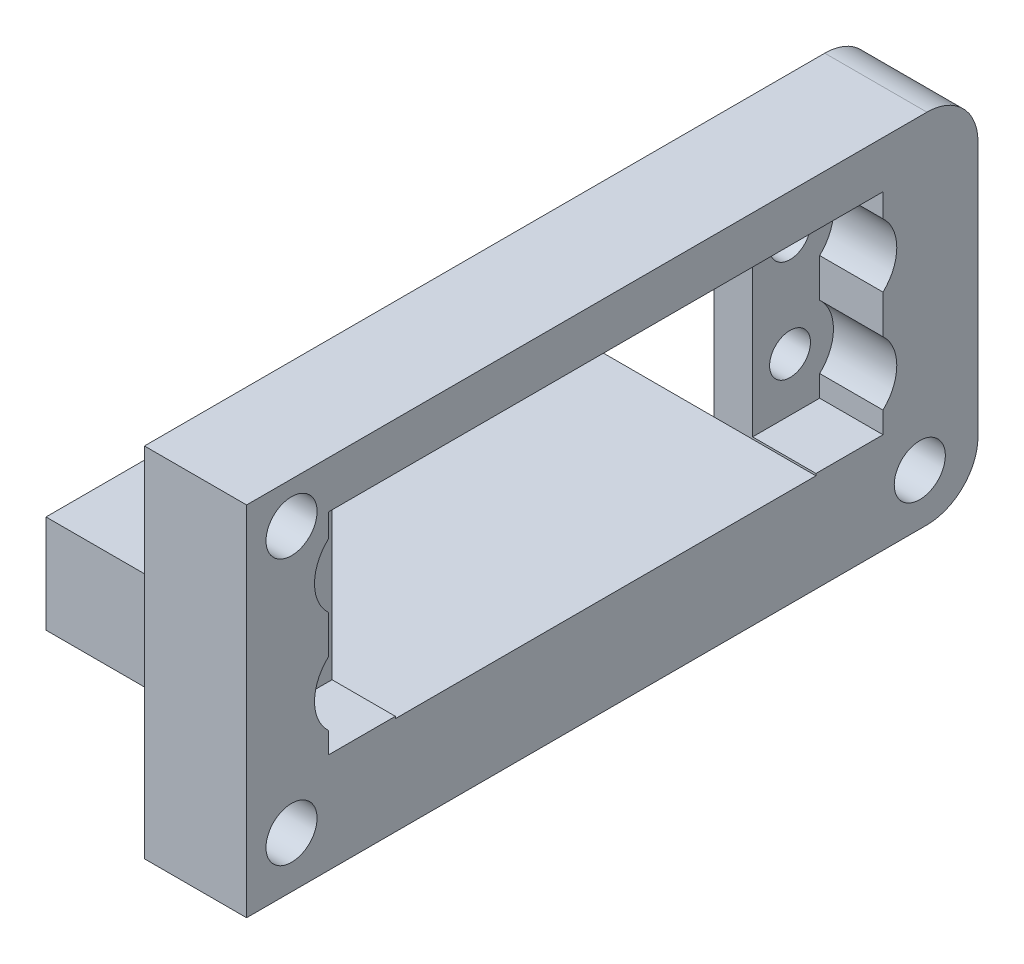
ISO-10303-21;
HEADER;
FILE_DESCRIPTION(('STEP AP214'),'2;1');
FILE_NAME('part.step','',(''),(''),'','','');
FILE_SCHEMA(('AUTOMOTIVE_DESIGN { 1 0 10303 214 1 1 1 1 }'));
ENDSEC;
DATA;
#1=APPLICATION_CONTEXT('core data for automotive mechanical design processes');
#2=APPLICATION_PROTOCOL_DEFINITION('international standard','automotive_design',2000,#1);
#3=PRODUCT_CONTEXT('',#1,'mechanical');
#4=PRODUCT('Part','Part','',(#3));
#5=PRODUCT_RELATED_PRODUCT_CATEGORY('part','',(#4));
#6=PRODUCT_DEFINITION_FORMATION('','',#4);
#7=PRODUCT_DEFINITION_CONTEXT('part definition',#1,'design');
#8=PRODUCT_DEFINITION('design','',#6,#7);
#9=PRODUCT_DEFINITION_SHAPE('','',#8);
#10=(LENGTH_UNIT() NAMED_UNIT(*) SI_UNIT(.MILLI.,.METRE.));
#11=(NAMED_UNIT(*) PLANE_ANGLE_UNIT() SI_UNIT($,.RADIAN.));
#12=(NAMED_UNIT(*) SI_UNIT($,.STERADIAN.) SOLID_ANGLE_UNIT());
#13=UNCERTAINTY_MEASURE_WITH_UNIT(LENGTH_MEASURE(1.E-05),#10,'distance_accuracy_value','');
#14=(GEOMETRIC_REPRESENTATION_CONTEXT(3) GLOBAL_UNCERTAINTY_ASSIGNED_CONTEXT((#13)) GLOBAL_UNIT_ASSIGNED_CONTEXT((#10,
#11,#12)) REPRESENTATION_CONTEXT('',''));
#15=CARTESIAN_POINT('',(0.,0.,0.));
#16=DIRECTION('',(0.,0.,1.));
#17=DIRECTION('',(1.,0.,0.));
#18=AXIS2_PLACEMENT_3D('',#15,#16,#17);
#19=CARTESIAN_POINT('',(-98.3966749620083,0.,-51.95));
#20=DIRECTION('',(0.,0.,1.));
#21=DIRECTION('',(1.,0.,0.));
#22=AXIS2_PLACEMENT_3D('',#19,#20,#21);
#23=PLANE('',#22);
#24=DIRECTION('',(1.,0.,0.));
#25=VECTOR('',#24,1.);
#26=CARTESIAN_POINT('',(-25.058655518268,11.8931527234188,-51.95));
#27=LINE('',#26,#25);
#28=CARTESIAN_POINT('',(-18.7,11.8931527234188,-51.95));
#29=VERTEX_POINT('',#28);
#30=CARTESIAN_POINT('',(-12.5,11.8931527234188,-51.95));
#31=VERTEX_POINT('',#30);
#32=EDGE_CURVE('E476',#29,#31,#27,.T.);
#33=ORIENTED_EDGE('',*,*,#32,.F.);
#34=DIRECTION('',(0.,-1.,0.));
#35=VECTOR('',#34,1.);
#36=CARTESIAN_POINT('',(-18.7,0.,-51.95));
#37=LINE('',#36,#35);
#38=CARTESIAN_POINT('',(-18.7,9.79999999999999,-51.95));
#39=VERTEX_POINT('',#38);
#40=EDGE_CURVE('E285',#29,#39,#37,.T.);
#41=ORIENTED_EDGE('',*,*,#40,.T.);
#42=DIRECTION('',(1.,0.,0.));
#43=VECTOR('',#42,1.);
#44=CARTESIAN_POINT('',(-98.3966749620083,9.79999999999999,-51.95));
#45=LINE('',#44,#43);
#46=CARTESIAN_POINT('',(-12.5,9.79999999999999,-51.95));
#47=VERTEX_POINT('',#46);
#48=EDGE_CURVE('E283',#39,#47,#45,.T.);
#49=ORIENTED_EDGE('',*,*,#48,.T.);
#50=DIRECTION('',(0.,-1.,0.));
#51=VECTOR('',#50,1.);
#52=CARTESIAN_POINT('',(-12.5,0.,-51.95));
#53=LINE('',#52,#51);
#54=EDGE_CURVE('E518',#31,#47,#53,.T.);
#55=ORIENTED_EDGE('',*,*,#54,.F.);
#56=EDGE_LOOP('',(#33,#41,#49,#55));
#57=FACE_BOUND('',#56,.T.);
#58=ADVANCED_FACE('F45',(#57),#23,.T.);
#59=DIRECTION('',(1.,0.,0.));
#60=VECTOR('',#59,1.);
#61=CARTESIAN_POINT('',(-25.058655518268,18.1068472765812,-51.95));
#62=LINE('',#61,#60);
#63=CARTESIAN_POINT('',(-18.7,18.1068472765812,-51.95));
#64=VERTEX_POINT('',#63);
#65=CARTESIAN_POINT('',(-12.5,18.1068472765812,-51.95));
#66=VERTEX_POINT('',#65);
#67=EDGE_CURVE('E488',#64,#66,#62,.T.);
#68=ORIENTED_EDGE('',*,*,#67,.T.);
#69=CARTESIAN_POINT('',(-12.5,21.8931527234188,-51.95));
#70=VERTEX_POINT('',#69);
#71=EDGE_CURVE('E519',#70,#66,#53,.T.);
#72=ORIENTED_EDGE('',*,*,#71,.F.);
#73=DIRECTION('',(1.,0.,0.));
#74=VECTOR('',#73,1.);
#75=CARTESIAN_POINT('',(-25.058655518268,21.8931527234188,-51.95));
#76=LINE('',#75,#74);
#77=CARTESIAN_POINT('',(-18.7,21.8931527234188,-51.95));
#78=VERTEX_POINT('',#77);
#79=EDGE_CURVE('E448',#78,#70,#76,.T.);
#80=ORIENTED_EDGE('',*,*,#79,.F.);
#81=EDGE_CURVE('E284',#78,#64,#37,.T.);
#82=ORIENTED_EDGE('',*,*,#81,.T.);
#83=EDGE_LOOP('',(#68,#72,#80,#82));
#84=FACE_BOUND('',#83,.T.);
#85=ADVANCED_FACE('F527',(#84),#23,.T.);
#86=CARTESIAN_POINT('',(-98.3966749620083,0.,2.35));
#87=DIRECTION('',(0.,0.,1.));
#88=DIRECTION('',(0.,-1.,0.));
#89=AXIS2_PLACEMENT_3D('',#86,#87,#88);
#90=PLANE('',#89);
#91=DIRECTION('',(0.,-1.,0.));
#92=VECTOR('',#91,1.);
#93=CARTESIAN_POINT('',(-18.7,0.,2.35));
#94=LINE('',#93,#92);
#95=CARTESIAN_POINT('',(-18.7,21.8931527234188,2.35));
#96=VERTEX_POINT('',#95);
#97=CARTESIAN_POINT('',(-18.7,18.1068472765812,2.35));
#98=VERTEX_POINT('',#97);
#99=EDGE_CURVE('E54',#96,#98,#94,.T.);
#100=ORIENTED_EDGE('',*,*,#99,.F.);
#101=DIRECTION('',(1.,0.,0.));
#102=VECTOR('',#101,1.);
#103=CARTESIAN_POINT('',(-25.058655518268,21.8931527234188,2.35));
#104=LINE('',#103,#102);
#105=CARTESIAN_POINT('',(-12.5,21.8931527234188,2.35));
#106=VERTEX_POINT('',#105);
#107=EDGE_CURVE('E480',#96,#106,#104,.T.);
#108=ORIENTED_EDGE('',*,*,#107,.T.);
#109=DIRECTION('',(0.,-1.,0.));
#110=VECTOR('',#109,1.);
#111=CARTESIAN_POINT('',(-12.5,0.,2.35));
#112=LINE('',#111,#110);
#113=CARTESIAN_POINT('',(-12.5,18.1068472765812,2.35));
#114=VERTEX_POINT('',#113);
#115=EDGE_CURVE('E253',#106,#114,#112,.T.);
#116=ORIENTED_EDGE('',*,*,#115,.T.);
#117=DIRECTION('',(1.,0.,0.));
#118=VECTOR('',#117,1.);
#119=CARTESIAN_POINT('',(-25.058655518268,18.1068472765812,2.35));
#120=LINE('',#119,#118);
#121=EDGE_CURVE('E233',#98,#114,#120,.T.);
#122=ORIENTED_EDGE('',*,*,#121,.F.);
#123=EDGE_LOOP('',(#100,#108,#116,#122));
#124=FACE_BOUND('',#123,.T.);
#125=ADVANCED_FACE('F500',(#124),#90,.F.);
#126=CARTESIAN_POINT('',(-18.7,11.8931527234188,2.35));
#127=VERTEX_POINT('',#126);
#128=CARTESIAN_POINT('',(-18.7,9.79999999999999,2.35));
#129=VERTEX_POINT('',#128);
#130=EDGE_CURVE('E56',#127,#129,#94,.T.);
#131=ORIENTED_EDGE('',*,*,#130,.F.);
#132=DIRECTION('',(1.,0.,0.));
#133=VECTOR('',#132,1.);
#134=CARTESIAN_POINT('',(-25.058655518268,11.8931527234188,2.35));
#135=LINE('',#134,#133);
#136=CARTESIAN_POINT('',(-12.5,11.8931527234188,2.35));
#137=VERTEX_POINT('',#136);
#138=EDGE_CURVE('E230',#127,#137,#135,.T.);
#139=ORIENTED_EDGE('',*,*,#138,.T.);
#140=CARTESIAN_POINT('',(-12.5,9.79999999999999,2.35));
#141=VERTEX_POINT('',#140);
#142=EDGE_CURVE('E243',#137,#141,#112,.T.);
#143=ORIENTED_EDGE('',*,*,#142,.T.);
#144=DIRECTION('',(1.,0.,0.));
#145=VECTOR('',#144,1.);
#146=CARTESIAN_POINT('',(-98.3966749620083,9.79999999999999,2.35));
#147=LINE('',#146,#145);
#148=EDGE_CURVE('E267',#129,#141,#147,.T.);
#149=ORIENTED_EDGE('',*,*,#148,.F.);
#150=EDGE_LOOP('',(#131,#139,#143,#149));
#151=FACE_BOUND('',#150,.T.);
#152=ADVANCED_FACE('F241',(#151),#90,.F.);
#153=CARTESIAN_POINT('',(-22.5,0.,0.));
#154=DIRECTION('',(-1.,0.,0.));
#155=DIRECTION('',(0.,0.,1.));
#156=AXIS2_PLACEMENT_3D('',#153,#154,#155);
#157=PLANE('',#156);
#158=CARTESIAN_POINT('',(-22.5,15.,-0.550000000000007));
#159=DIRECTION('',(-1.,0.,0.));
#160=DIRECTION('',(0.,0.,1.));
#161=AXIS2_PLACEMENT_3D('',#158,#159,#160);
#162=CIRCLE('',#161,2.00000000000001);
#163=CARTESIAN_POINT('',(-22.5,15.,1.45));
#164=VERTEX_POINT('',#163);
#165=EDGE_CURVE('E322',#164,#164,#162,.T.);
#166=ORIENTED_EDGE('',*,*,#165,.F.);
#167=EDGE_LOOP('',(#166));
#168=FACE_BOUND('',#167,.T.);
#169=CARTESIAN_POINT('',(-22.5,15.,-49.05));
#170=DIRECTION('',(-1.,0.,0.));
#171=DIRECTION('',(0.,0.,1.));
#172=AXIS2_PLACEMENT_3D('',#169,#170,#171);
#173=CIRCLE('',#172,2.00000000000002);
#174=CARTESIAN_POINT('',(-22.5,15.,-47.05));
#175=VERTEX_POINT('',#174);
#176=EDGE_CURVE('E328',#175,#175,#173,.T.);
#177=ORIENTED_EDGE('',*,*,#176,.F.);
#178=EDGE_LOOP('',(#177));
#179=FACE_BOUND('',#178,.T.);
#180=CARTESIAN_POINT('',(-22.5,25.,-49.05));
#181=DIRECTION('',(-1.,0.,0.));
#182=DIRECTION('',(0.,0.,1.));
#183=AXIS2_PLACEMENT_3D('',#180,#181,#182);
#184=CIRCLE('',#183,2.00000000000002);
#185=CARTESIAN_POINT('',(-22.5,25.,-47.05));
#186=VERTEX_POINT('',#185);
#187=EDGE_CURVE('E333',#186,#186,#184,.T.);
#188=ORIENTED_EDGE('',*,*,#187,.F.);
#189=EDGE_LOOP('',(#188));
#190=FACE_BOUND('',#189,.T.);
#191=CARTESIAN_POINT('',(-22.5,25.,-0.550000000000007));
#192=DIRECTION('',(-1.,0.,0.));
#193=DIRECTION('',(0.,0.,1.));
#194=AXIS2_PLACEMENT_3D('',#191,#192,#193);
#195=CIRCLE('',#194,2.00000000000002);
#196=CARTESIAN_POINT('',(-22.5,25.,1.45000000000001));
#197=VERTEX_POINT('',#196);
#198=EDGE_CURVE('E341',#197,#197,#195,.T.);
#199=ORIENTED_EDGE('',*,*,#198,.F.);
#200=EDGE_LOOP('',(#199));
#201=FACE_BOUND('',#200,.T.);
#202=CARTESIAN_POINT('',(-22.5,31.,5.95));
#203=DIRECTION('',(-1.,0.,0.));
#204=DIRECTION('',(0.,0.,1.));
#205=AXIS2_PLACEMENT_3D('',#202,#203,#204);
#206=CIRCLE('',#205,2.5);
#207=CARTESIAN_POINT('',(-22.5,31.,8.44999999999999));
#208=VERTEX_POINT('',#207);
#209=EDGE_CURVE('E344',#208,#208,#206,.T.);
#210=ORIENTED_EDGE('',*,*,#209,.F.);
#211=EDGE_LOOP('',(#210));
#212=FACE_BOUND('',#211,.T.);
#213=CARTESIAN_POINT('',(-22.5,5.,-55.55));
#214=DIRECTION('',(-1.,0.,0.));
#215=DIRECTION('',(0.,0.,1.));
#216=AXIS2_PLACEMENT_3D('',#213,#214,#215);
#217=CIRCLE('',#216,2.50000000000001);
#218=CARTESIAN_POINT('',(-22.5,5.,-53.05));
#219=VERTEX_POINT('',#218);
#220=EDGE_CURVE('E348',#219,#219,#217,.T.);
#221=ORIENTED_EDGE('',*,*,#220,.F.);
#222=EDGE_LOOP('',(#221));
#223=FACE_BOUND('',#222,.T.);
#224=CARTESIAN_POINT('',(-22.5,5.,5.94999999999999));
#225=DIRECTION('',(-1.,0.,0.));
#226=DIRECTION('',(0.,0.,1.));
#227=AXIS2_PLACEMENT_3D('',#224,#225,#226);
#228=CIRCLE('',#227,2.5);
#229=CARTESIAN_POINT('',(-22.5,5.,8.44999999999999));
#230=VERTEX_POINT('',#229);
#231=EDGE_CURVE('E354',#230,#230,#228,.T.);
#232=ORIENTED_EDGE('',*,*,#231,.F.);
#233=EDGE_LOOP('',(#232));
#234=FACE_BOUND('',#233,.T.);
#235=DIRECTION('',(0.,-1.,0.));
#236=VECTOR('',#235,1.);
#237=CARTESIAN_POINT('',(-22.5,0.,-4.21339745962156));
#238=LINE('',#237,#236);
#239=CARTESIAN_POINT('',(-22.5,30.4,-4.21339745962155));
#240=VERTEX_POINT('',#239);
#241=CARTESIAN_POINT('',(-22.5,9.59999999999999,-4.21339745962156));
#242=VERTEX_POINT('',#241);
#243=EDGE_CURVE('E390',#240,#242,#238,.T.);
#244=ORIENTED_EDGE('',*,*,#243,.T.);
#245=DIRECTION('',(0.,-1.,0.));
#246=VECTOR('',#245,1.);
#247=CARTESIAN_POINT('',(-22.5,0.,-4.21339745962156));
#248=LINE('',#247,#246);
#249=CARTESIAN_POINT('',(-22.5,0.,-4.21339745962156));
#250=VERTEX_POINT('',#249);
#251=EDGE_CURVE('E441',#242,#250,#248,.T.);
#252=ORIENTED_EDGE('',*,*,#251,.T.);
#253=DIRECTION('',(0.,0.,1.));
#254=VECTOR('',#253,1.);
#255=CARTESIAN_POINT('',(-22.5,0.,0.));
#256=LINE('',#255,#254);
#257=CARTESIAN_POINT('',(-22.5,0.,10.35));
#258=VERTEX_POINT('',#257);
#259=EDGE_CURVE('E372',#250,#258,#256,.T.);
#260=ORIENTED_EDGE('',*,*,#259,.T.);
#261=DIRECTION('',(0.,1.,0.));
#262=VECTOR('',#261,1.);
#263=CARTESIAN_POINT('',(-22.5,0.,10.35));
#264=LINE('',#263,#262);
#265=CARTESIAN_POINT('',(-22.5,35.,10.35));
#266=VERTEX_POINT('',#265);
#267=EDGE_CURVE('E371',#258,#266,#264,.T.);
#268=ORIENTED_EDGE('',*,*,#267,.T.);
#269=DIRECTION('',(0.,0.,-1.));
#270=VECTOR('',#269,1.);
#271=CARTESIAN_POINT('',(-22.5,35.,0.));
#272=LINE('',#271,#270);
#273=CARTESIAN_POINT('',(-22.5,35.,-56.25));
#274=VERTEX_POINT('',#273);
#275=EDGE_CURVE('E375',#266,#274,#272,.T.);
#276=ORIENTED_EDGE('',*,*,#275,.T.);
#277=CARTESIAN_POINT('',(-22.5,30.,-56.25));
#278=DIRECTION('',(-1.,0.,0.));
#279=DIRECTION('',(0.,0.,1.));
#280=AXIS2_PLACEMENT_3D('',#277,#278,#279);
#281=CIRCLE('',#280,5.);
#282=CARTESIAN_POINT('',(-22.5,30.,-61.25));
#283=VERTEX_POINT('',#282);
#284=EDGE_CURVE('E378',#274,#283,#281,.T.);
#285=ORIENTED_EDGE('',*,*,#284,.T.);
#286=DIRECTION('',(0.,-1.,0.));
#287=VECTOR('',#286,1.);
#288=CARTESIAN_POINT('',(-22.5,0.,-61.25));
#289=LINE('',#288,#287);
#290=CARTESIAN_POINT('',(-22.5,5.,-61.25));
#291=VERTEX_POINT('',#290);
#292=EDGE_CURVE('E381',#283,#291,#289,.T.);
#293=ORIENTED_EDGE('',*,*,#292,.T.);
#294=CARTESIAN_POINT('',(-22.5,5.,-56.25));
#295=DIRECTION('',(-1.,0.,0.));
#296=DIRECTION('',(0.,0.,1.));
#297=AXIS2_PLACEMENT_3D('',#294,#295,#296);
#298=CIRCLE('',#297,5.);
#299=CARTESIAN_POINT('',(-22.5,0.,-56.25));
#300=VERTEX_POINT('',#299);
#301=EDGE_CURVE('E384',#291,#300,#298,.T.);
#302=ORIENTED_EDGE('',*,*,#301,.T.);
#303=CARTESIAN_POINT('',(-22.5,0.,-45.3866025403785));
#304=VERTEX_POINT('',#303);
#305=EDGE_CURVE('E369',#300,#304,#256,.T.);
#306=ORIENTED_EDGE('',*,*,#305,.T.);
#307=DIRECTION('',(0.,-1.,0.));
#308=VECTOR('',#307,1.);
#309=CARTESIAN_POINT('',(-22.5,0.,-45.3866025403785));
#310=LINE('',#309,#308);
#311=CARTESIAN_POINT('',(-22.5,9.59999999999999,-45.3866025403785));
#312=VERTEX_POINT('',#311);
#313=EDGE_CURVE('E447',#312,#304,#310,.T.);
#314=ORIENTED_EDGE('',*,*,#313,.F.);
#315=DIRECTION('',(0.,1.,0.));
#316=VECTOR('',#315,1.);
#317=CARTESIAN_POINT('',(-22.5,0.,-45.3866025403785));
#318=LINE('',#317,#316);
#319=CARTESIAN_POINT('',(-22.5,30.4,-45.3866025403785));
#320=VERTEX_POINT('',#319);
#321=EDGE_CURVE('E393',#312,#320,#318,.T.);
#322=ORIENTED_EDGE('',*,*,#321,.T.);
#323=DIRECTION('',(0.,0.,1.));
#324=VECTOR('',#323,1.);
#325=CARTESIAN_POINT('',(-22.5,30.4,0.));
#326=LINE('',#325,#324);
#327=EDGE_CURVE('E387',#320,#240,#326,.T.);
#328=ORIENTED_EDGE('',*,*,#327,.T.);
#329=EDGE_LOOP('',(#244,#252,#260,#268,#276,#285,#293,#302,#306,#314,#322,#328));
#330=FACE_BOUND('',#329,.T.);
#331=ADVANCED_FACE('F543',(#168,#179,#190,#201,#212,#223,#234,#330),#157,.T.);
#332=CARTESIAN_POINT('',(-98.3966749620083,0.,10.35));
#333=DIRECTION('',(0.,0.,-1.));
#334=DIRECTION('',(0.,1.,0.));
#335=AXIS2_PLACEMENT_3D('',#332,#333,#334);
#336=PLANE('',#335);
#337=DIRECTION('',(1.,0.,0.));
#338=VECTOR('',#337,1.);
#339=CARTESIAN_POINT('',(-98.3966749620083,35.,10.35));
#340=LINE('',#339,#338);
#341=CARTESIAN_POINT('',(-12.5,35.,10.35));
#342=VERTEX_POINT('',#341);
#343=EDGE_CURVE('E291',#266,#342,#340,.T.);
#344=ORIENTED_EDGE('',*,*,#343,.F.);
#345=ORIENTED_EDGE('',*,*,#267,.F.);
#346=DIRECTION('',(1.,0.,0.));
#347=VECTOR('',#346,1.);
#348=CARTESIAN_POINT('',(-98.3966749620083,0.,10.35));
#349=LINE('',#348,#347);
#350=CARTESIAN_POINT('',(-12.5,0.,10.35));
#351=VERTEX_POINT('',#350);
#352=EDGE_CURVE('E307',#258,#351,#349,.T.);
#353=ORIENTED_EDGE('',*,*,#352,.T.);
#354=DIRECTION('',(0.,1.,0.));
#355=VECTOR('',#354,1.);
#356=CARTESIAN_POINT('',(-12.5,0.,10.35));
#357=LINE('',#356,#355);
#358=EDGE_CURVE('E294',#351,#342,#357,.T.);
#359=ORIENTED_EDGE('',*,*,#358,.T.);
#360=EDGE_LOOP('',(#344,#345,#353,#359));
#361=FACE_BOUND('',#360,.T.);
#362=ADVANCED_FACE('F47',(#361),#336,.F.);
#363=CARTESIAN_POINT('',(-98.3966749620083,35.,0.));
#364=DIRECTION('',(0.,-1.,0.));
#365=DIRECTION('',(0.,0.,-1.));
#366=AXIS2_PLACEMENT_3D('',#363,#364,#365);
#367=PLANE('',#366);
#368=DIRECTION('',(1.,0.,0.));
#369=VECTOR('',#368,1.);
#370=CARTESIAN_POINT('',(-98.3966749620083,35.,-56.25));
#371=LINE('',#370,#369);
#372=CARTESIAN_POINT('',(-12.5,35.,-56.25));
#373=VERTEX_POINT('',#372);
#374=EDGE_CURVE('E295',#274,#373,#371,.T.);
#375=ORIENTED_EDGE('',*,*,#374,.F.);
#376=ORIENTED_EDGE('',*,*,#275,.F.);
#377=ORIENTED_EDGE('',*,*,#343,.T.);
#378=DIRECTION('',(0.,0.,-1.));
#379=VECTOR('',#378,1.);
#380=CARTESIAN_POINT('',(-12.5,35.,0.));
#381=LINE('',#380,#379);
#382=EDGE_CURVE('E293',#342,#373,#381,.T.);
#383=ORIENTED_EDGE('',*,*,#382,.T.);
#384=EDGE_LOOP('',(#375,#376,#377,#383));
#385=FACE_BOUND('',#384,.T.);
#386=ADVANCED_FACE('F792',(#385),#367,.F.);
#387=CARTESIAN_POINT('',(-98.3966749620083,30.,-56.25));
#388=DIRECTION('',(1.,0.,0.));
#389=DIRECTION('',(0.,0.,-1.));
#390=AXIS2_PLACEMENT_3D('',#387,#388,#389);
#391=CYLINDRICAL_SURFACE('',#390,5.);
#392=DIRECTION('',(1.,0.,0.));
#393=VECTOR('',#392,1.);
#394=CARTESIAN_POINT('',(-98.3966749620083,30.,-61.25));
#395=LINE('',#394,#393);
#396=CARTESIAN_POINT('',(-12.5,30.,-61.25));
#397=VERTEX_POINT('',#396);
#398=EDGE_CURVE('E298',#283,#397,#395,.T.);
#399=ORIENTED_EDGE('',*,*,#398,.F.);
#400=ORIENTED_EDGE('',*,*,#284,.F.);
#401=ORIENTED_EDGE('',*,*,#374,.T.);
#402=CARTESIAN_POINT('',(-12.5,30.,-56.25));
#403=DIRECTION('',(-1.,0.,0.));
#404=DIRECTION('',(0.,0.,1.));
#405=AXIS2_PLACEMENT_3D('',#402,#403,#404);
#406=CIRCLE('',#405,5.);
#407=EDGE_CURVE('E297',#373,#397,#406,.T.);
#408=ORIENTED_EDGE('',*,*,#407,.T.);
#409=EDGE_LOOP('',(#399,#400,#401,#408));
#410=FACE_BOUND('',#409,.T.);
#411=ADVANCED_FACE('F800',(#410),#391,.T.);
#412=CARTESIAN_POINT('',(-98.3966749620083,0.,-61.25));
#413=DIRECTION('',(0.,0.,1.));
#414=DIRECTION('',(1.,0.,0.));
#415=AXIS2_PLACEMENT_3D('',#412,#413,#414);
#416=PLANE('',#415);
#417=DIRECTION('',(1.,0.,0.));
#418=VECTOR('',#417,1.);
#419=CARTESIAN_POINT('',(-98.3966749620083,5.,-61.25));
#420=LINE('',#419,#418);
#421=CARTESIAN_POINT('',(-12.5,5.,-61.25));
#422=VERTEX_POINT('',#421);
#423=EDGE_CURVE('E301',#291,#422,#420,.T.);
#424=ORIENTED_EDGE('',*,*,#423,.F.);
#425=ORIENTED_EDGE('',*,*,#292,.F.);
#426=ORIENTED_EDGE('',*,*,#398,.T.);
#427=DIRECTION('',(0.,-1.,0.));
#428=VECTOR('',#427,1.);
#429=CARTESIAN_POINT('',(-12.5,0.,-61.25));
#430=LINE('',#429,#428);
#431=EDGE_CURVE('E300',#397,#422,#430,.T.);
#432=ORIENTED_EDGE('',*,*,#431,.T.);
#433=EDGE_LOOP('',(#424,#425,#426,#432));
#434=FACE_BOUND('',#433,.T.);
#435=ADVANCED_FACE('F807',(#434),#416,.F.);
#436=CARTESIAN_POINT('',(-98.3966749620083,5.,-56.25));
#437=DIRECTION('',(1.,0.,0.));
#438=DIRECTION('',(0.,0.,-1.));
#439=AXIS2_PLACEMENT_3D('',#436,#437,#438);
#440=CYLINDRICAL_SURFACE('',#439,5.);
#441=DIRECTION('',(1.,0.,0.));
#442=VECTOR('',#441,1.);
#443=CARTESIAN_POINT('',(-98.3966749620083,0.,-56.25));
#444=LINE('',#443,#442);
#445=CARTESIAN_POINT('',(-12.5,0.,-56.25));
#446=VERTEX_POINT('',#445);
#447=EDGE_CURVE('E303',#300,#446,#444,.T.);
#448=ORIENTED_EDGE('',*,*,#447,.F.);
#449=ORIENTED_EDGE('',*,*,#301,.F.);
#450=ORIENTED_EDGE('',*,*,#423,.T.);
#451=CARTESIAN_POINT('',(-12.5,5.,-56.25));
#452=DIRECTION('',(-1.,0.,0.));
#453=DIRECTION('',(0.,0.,1.));
#454=AXIS2_PLACEMENT_3D('',#451,#452,#453);
#455=CIRCLE('',#454,5.);
#456=EDGE_CURVE('E290',#422,#446,#455,.T.);
#457=ORIENTED_EDGE('',*,*,#456,.T.);
#458=EDGE_LOOP('',(#448,#449,#450,#457));
#459=FACE_BOUND('',#458,.T.);
#460=ADVANCED_FACE('F578',(#459),#440,.T.);
#461=CARTESIAN_POINT('',(-98.3966749620083,9.79999999999999,0.));
#462=DIRECTION('',(0.,1.,0.));
#463=DIRECTION('',(0.,0.,1.));
#464=AXIS2_PLACEMENT_3D('',#461,#462,#463);
#465=PLANE('',#464);
#466=ORIENTED_EDGE('',*,*,#48,.F.);
#467=DIRECTION('',(0.,0.,1.));
#468=VECTOR('',#467,1.);
#469=CARTESIAN_POINT('',(-18.7,9.79999999999999,0.));
#470=LINE('',#469,#468);
#471=CARTESIAN_POINT('',(-18.7,9.79999999999999,-45.3866025403785));
#472=VERTEX_POINT('',#471);
#473=EDGE_CURVE('E286',#39,#472,#470,.T.);
#474=ORIENTED_EDGE('',*,*,#473,.T.);
#475=DIRECTION('',(1.,0.,0.));
#476=VECTOR('',#475,1.);
#477=CARTESIAN_POINT('',(-98.3966749620083,9.79999999999999,-45.3866025403785));
#478=LINE('',#477,#476);
#479=CARTESIAN_POINT('',(-12.5,9.79999999999999,-45.3866025403785));
#480=VERTEX_POINT('',#479);
#481=EDGE_CURVE('E289',#472,#480,#478,.T.);
#482=ORIENTED_EDGE('',*,*,#481,.T.);
#483=DIRECTION('',(0.,0.,1.));
#484=VECTOR('',#483,1.);
#485=CARTESIAN_POINT('',(-12.5,9.79999999999999,0.));
#486=LINE('',#485,#484);
#487=EDGE_CURVE('E274',#47,#480,#486,.T.);
#488=ORIENTED_EDGE('',*,*,#487,.F.);
#489=EDGE_LOOP('',(#466,#474,#482,#488));
#490=FACE_BOUND('',#489,.T.);
#491=ADVANCED_FACE('F538',(#490),#465,.T.);
#492=DIRECTION('',(1.,0.,0.));
#493=VECTOR('',#492,1.);
#494=CARTESIAN_POINT('',(-25.058655518268,28.1068472765812,-51.95));
#495=LINE('',#494,#493);
#496=CARTESIAN_POINT('',(-18.7,28.1068472765812,-51.95));
#497=VERTEX_POINT('',#496);
#498=CARTESIAN_POINT('',(-12.5,28.1068472765812,-51.95));
#499=VERTEX_POINT('',#498);
#500=EDGE_CURVE('E452',#497,#499,#495,.T.);
#501=ORIENTED_EDGE('',*,*,#500,.T.);
#502=CARTESIAN_POINT('',(-12.5,30.4,-51.95));
#503=VERTEX_POINT('',#502);
#504=EDGE_CURVE('E520',#503,#499,#53,.T.);
#505=ORIENTED_EDGE('',*,*,#504,.F.);
#506=DIRECTION('',(1.,0.,0.));
#507=VECTOR('',#506,1.);
#508=CARTESIAN_POINT('',(-98.3966749620083,30.4,-51.95));
#509=LINE('',#508,#507);
#510=CARTESIAN_POINT('',(-18.7,30.4,-51.95));
#511=VERTEX_POINT('',#510);
#512=EDGE_CURVE('E257',#511,#503,#509,.T.);
#513=ORIENTED_EDGE('',*,*,#512,.F.);
#514=EDGE_CURVE('E280',#511,#497,#37,.T.);
#515=ORIENTED_EDGE('',*,*,#514,.T.);
#516=EDGE_LOOP('',(#501,#505,#513,#515));
#517=FACE_BOUND('',#516,.T.);
#518=ADVANCED_FACE('F563',(#517),#23,.T.);
#519=CARTESIAN_POINT('',(-98.3966749620083,30.4,0.));
#520=DIRECTION('',(0.,-1.,0.));
#521=DIRECTION('',(0.,0.,-1.));
#522=AXIS2_PLACEMENT_3D('',#519,#520,#521);
#523=PLANE('',#522);
#524=DIRECTION('',(1.,0.,0.));
#525=VECTOR('',#524,1.);
#526=CARTESIAN_POINT('',(-98.3966749620083,30.4,2.34999999999999));
#527=LINE('',#526,#525);
#528=CARTESIAN_POINT('',(-18.7,30.4,2.34999999999999));
#529=VERTEX_POINT('',#528);
#530=CARTESIAN_POINT('',(-12.5,30.4,2.34999999999999));
#531=VERTEX_POINT('',#530);
#532=EDGE_CURVE('E254',#529,#531,#527,.T.);
#533=ORIENTED_EDGE('',*,*,#532,.F.);
#534=DIRECTION('',(0.,0.,-1.));
#535=VECTOR('',#534,1.);
#536=CARTESIAN_POINT('',(-18.7,30.4,0.));
#537=LINE('',#536,#535);
#538=CARTESIAN_POINT('',(-18.7,30.4,-4.21339745962156));
#539=VERTEX_POINT('',#538);
#540=EDGE_CURVE('E277',#529,#539,#537,.T.);
#541=ORIENTED_EDGE('',*,*,#540,.T.);
#542=DIRECTION('',(1.,0.,0.));
#543=VECTOR('',#542,1.);
#544=CARTESIAN_POINT('',(-22.5,30.4,-4.21339745962155));
#545=LINE('',#544,#543);
#546=EDGE_CURVE('E309',#240,#539,#545,.T.);
#547=ORIENTED_EDGE('',*,*,#546,.F.);
#548=ORIENTED_EDGE('',*,*,#327,.F.);
#549=DIRECTION('',(1.,0.,0.));
#550=VECTOR('',#549,1.);
#551=CARTESIAN_POINT('',(-22.5,30.4,-45.3866025403785));
#552=LINE('',#551,#550);
#553=CARTESIAN_POINT('',(-18.7,30.4,-45.3866025403785));
#554=VERTEX_POINT('',#553);
#555=EDGE_CURVE('E395',#320,#554,#552,.T.);
#556=ORIENTED_EDGE('',*,*,#555,.T.);
#557=EDGE_CURVE('E279',#554,#511,#537,.T.);
#558=ORIENTED_EDGE('',*,*,#557,.T.);
#559=ORIENTED_EDGE('',*,*,#512,.T.);
#560=DIRECTION('',(0.,0.,-1.));
#561=VECTOR('',#560,1.);
#562=CARTESIAN_POINT('',(-12.5,30.4,0.));
#563=LINE('',#562,#561);
#564=EDGE_CURVE('E514',#531,#503,#563,.T.);
#565=ORIENTED_EDGE('',*,*,#564,.F.);
#566=EDGE_LOOP('',(#533,#541,#547,#548,#556,#558,#559,#565));
#567=FACE_BOUND('',#566,.T.);
#568=ADVANCED_FACE('F512',(#567),#523,.T.);
#569=CARTESIAN_POINT('',(-12.5,28.1068472765812,2.34999999999999));
#570=VERTEX_POINT('',#569);
#571=EDGE_CURVE('E256',#531,#570,#112,.T.);
#572=ORIENTED_EDGE('',*,*,#571,.T.);
#573=DIRECTION('',(1.,0.,0.));
#574=VECTOR('',#573,1.);
#575=CARTESIAN_POINT('',(-25.058655518268,28.1068472765812,2.34999999999999));
#576=LINE('',#575,#574);
#577=CARTESIAN_POINT('',(-18.7,28.1068472765812,2.35));
#578=VERTEX_POINT('',#577);
#579=EDGE_CURVE('E477',#578,#570,#576,.T.);
#580=ORIENTED_EDGE('',*,*,#579,.F.);
#581=EDGE_CURVE('E11',#529,#578,#94,.T.);
#582=ORIENTED_EDGE('',*,*,#581,.F.);
#583=ORIENTED_EDGE('',*,*,#532,.T.);
#584=EDGE_LOOP('',(#572,#580,#582,#583));
#585=FACE_BOUND('',#584,.T.);
#586=ADVANCED_FACE('F507',(#585),#90,.F.);
#587=DIRECTION('',(1.,0.,0.));
#588=VECTOR('',#587,1.);
#589=CARTESIAN_POINT('',(-98.3966749620083,9.79999999999999,-4.21339745962156));
#590=LINE('',#589,#588);
#591=CARTESIAN_POINT('',(-18.7,9.79999999999999,-4.21339745962156));
#592=VERTEX_POINT('',#591);
#593=CARTESIAN_POINT('',(-12.5,9.79999999999999,-4.21339745962156));
#594=VERTEX_POINT('',#593);
#595=EDGE_CURVE('E271',#592,#594,#590,.T.);
#596=ORIENTED_EDGE('',*,*,#595,.F.);
#597=DIRECTION('',(0.,0.,1.));
#598=VECTOR('',#597,1.);
#599=CARTESIAN_POINT('',(-18.7,9.79999999999999,0.));
#600=LINE('',#599,#598);
#601=EDGE_CURVE('E262',#592,#129,#600,.T.);
#602=ORIENTED_EDGE('',*,*,#601,.T.);
#603=ORIENTED_EDGE('',*,*,#148,.T.);
#604=EDGE_CURVE('E252',#594,#141,#486,.T.);
#605=ORIENTED_EDGE('',*,*,#604,.F.);
#606=EDGE_LOOP('',(#596,#602,#603,#605));
#607=FACE_BOUND('',#606,.T.);
#608=ADVANCED_FACE('F580',(#607),#465,.T.);
#609=CARTESIAN_POINT('',(-98.3966749620083,0.,-4.21339745962156));
#610=DIRECTION('',(0.,0.,1.));
#611=DIRECTION('',(1.,0.,0.));
#612=AXIS2_PLACEMENT_3D('',#609,#610,#611);
#613=PLANE('',#612);
#614=DIRECTION('',(1.,0.,0.));
#615=VECTOR('',#614,1.);
#616=CARTESIAN_POINT('',(-98.3966749620083,9.59999999999999,-4.21339745962156));
#617=LINE('',#616,#615);
#618=CARTESIAN_POINT('',(-12.5,9.59999999999999,-4.21339745962156));
#619=VERTEX_POINT('',#618);
#620=EDGE_CURVE('E315',#242,#619,#617,.T.);
#621=ORIENTED_EDGE('',*,*,#620,.F.);
#622=ORIENTED_EDGE('',*,*,#243,.F.);
#623=ORIENTED_EDGE('',*,*,#546,.T.);
#624=DIRECTION('',(0.,-1.,0.));
#625=VECTOR('',#624,1.);
#626=CARTESIAN_POINT('',(-18.7,0.,-4.21339745962156));
#627=LINE('',#626,#625);
#628=EDGE_CURVE('E368',#539,#592,#627,.T.);
#629=ORIENTED_EDGE('',*,*,#628,.T.);
#630=ORIENTED_EDGE('',*,*,#595,.T.);
#631=DIRECTION('',(0.,-1.,0.));
#632=VECTOR('',#631,1.);
#633=CARTESIAN_POINT('',(-12.5,0.,-4.21339745962156));
#634=LINE('',#633,#632);
#635=EDGE_CURVE('E314',#594,#619,#634,.T.);
#636=ORIENTED_EDGE('',*,*,#635,.T.);
#637=EDGE_LOOP('',(#621,#622,#623,#629,#630,#636));
#638=FACE_BOUND('',#637,.T.);
#639=ADVANCED_FACE('F423',(#638),#613,.F.);
#640=CARTESIAN_POINT('',(-98.3966749620083,9.59999999999999,0.));
#641=DIRECTION('',(0.,-1.,0.));
#642=DIRECTION('',(0.,0.,-1.));
#643=AXIS2_PLACEMENT_3D('',#640,#641,#642);
#644=PLANE('',#643);
#645=DIRECTION('',(1.,0.,0.));
#646=VECTOR('',#645,1.);
#647=CARTESIAN_POINT('',(-98.3966749620083,9.59999999999999,-45.3866025403785));
#648=LINE('',#647,#646);
#649=CARTESIAN_POINT('',(-12.5,9.59999999999999,-45.3866025403785));
#650=VERTEX_POINT('',#649);
#651=EDGE_CURVE('E318',#312,#650,#648,.T.);
#652=ORIENTED_EDGE('',*,*,#651,.F.);
#653=DIRECTION('',(1.,0.,0.));
#654=VECTOR('',#653,1.);
#655=CARTESIAN_POINT('',(-88.9775687170167,9.59999999999999,-45.3866025403785));
#656=LINE('',#655,#654);
#657=CARTESIAN_POINT('',(-46.7,9.59999999999999,-45.3866025403785));
#658=VERTEX_POINT('',#657);
#659=EDGE_CURVE('E439',#658,#312,#656,.T.);
#660=ORIENTED_EDGE('',*,*,#659,.F.);
#661=DIRECTION('',(0.,0.,1.));
#662=VECTOR('',#661,1.);
#663=CARTESIAN_POINT('',(-46.7,9.59999999999999,0.));
#664=LINE('',#663,#662);
#665=CARTESIAN_POINT('',(-46.7,9.59999999999999,-4.21339745962156));
#666=VERTEX_POINT('',#665);
#667=EDGE_CURVE('E436',#658,#666,#664,.T.);
#668=ORIENTED_EDGE('',*,*,#667,.T.);
#669=DIRECTION('',(1.,0.,0.));
#670=VECTOR('',#669,1.);
#671=CARTESIAN_POINT('',(-88.9775687170167,9.59999999999999,-4.21339745962156));
#672=LINE('',#671,#670);
#673=EDGE_CURVE('E434',#666,#242,#672,.T.);
#674=ORIENTED_EDGE('',*,*,#673,.T.);
#675=ORIENTED_EDGE('',*,*,#620,.T.);
#676=DIRECTION('',(0.,0.,-1.));
#677=VECTOR('',#676,1.);
#678=CARTESIAN_POINT('',(-12.5,9.59999999999999,0.));
#679=LINE('',#678,#677);
#680=EDGE_CURVE('E317',#619,#650,#679,.T.);
#681=ORIENTED_EDGE('',*,*,#680,.T.);
#682=EDGE_LOOP('',(#652,#660,#668,#674,#675,#681));
#683=FACE_BOUND('',#682,.T.);
#684=ADVANCED_FACE('F428',(#683),#644,.F.);
#685=CARTESIAN_POINT('',(-98.3966749620083,0.,-45.3866025403785));
#686=DIRECTION('',(0.,0.,-1.));
#687=DIRECTION('',(-1.,0.,0.));
#688=AXIS2_PLACEMENT_3D('',#685,#686,#687);
#689=PLANE('',#688);
#690=ORIENTED_EDGE('',*,*,#481,.F.);
#691=DIRECTION('',(0.,1.,0.));
#692=VECTOR('',#691,1.);
#693=CARTESIAN_POINT('',(-18.7,0.,-45.3866025403785));
#694=LINE('',#693,#692);
#695=EDGE_CURVE('E398',#472,#554,#694,.T.);
#696=ORIENTED_EDGE('',*,*,#695,.T.);
#697=ORIENTED_EDGE('',*,*,#555,.F.);
#698=ORIENTED_EDGE('',*,*,#321,.F.);
#699=ORIENTED_EDGE('',*,*,#651,.T.);
#700=DIRECTION('',(0.,1.,0.));
#701=VECTOR('',#700,1.);
#702=CARTESIAN_POINT('',(-12.5,0.,-45.3866025403785));
#703=LINE('',#702,#701);
#704=EDGE_CURVE('E306',#650,#480,#703,.T.);
#705=ORIENTED_EDGE('',*,*,#704,.T.);
#706=EDGE_LOOP('',(#690,#696,#697,#698,#699,#705));
#707=FACE_BOUND('',#706,.T.);
#708=ADVANCED_FACE('F541',(#707),#689,.F.);
#709=CARTESIAN_POINT('',(-98.3966749620083,0.,0.));
#710=DIRECTION('',(0.,1.,0.));
#711=DIRECTION('',(0.,0.,1.));
#712=AXIS2_PLACEMENT_3D('',#709,#710,#711);
#713=PLANE('',#712);
#714=ORIENTED_EDGE('',*,*,#352,.F.);
#715=ORIENTED_EDGE('',*,*,#259,.F.);
#716=DIRECTION('',(1.,0.,0.));
#717=VECTOR('',#716,1.);
#718=CARTESIAN_POINT('',(-88.9775687170167,0.,-4.21339745962156));
#719=LINE('',#718,#717);
#720=CARTESIAN_POINT('',(-46.7,0.,-4.21339745962156));
#721=VERTEX_POINT('',#720);
#722=EDGE_CURVE('E444',#721,#250,#719,.T.);
#723=ORIENTED_EDGE('',*,*,#722,.F.);
#724=DIRECTION('',(0.,0.,-1.));
#725=VECTOR('',#724,1.);
#726=CARTESIAN_POINT('',(-46.7,0.,0.));
#727=LINE('',#726,#725);
#728=CARTESIAN_POINT('',(-46.7,0.,-45.3866025403785));
#729=VERTEX_POINT('',#728);
#730=EDGE_CURVE('E336',#721,#729,#727,.T.);
#731=ORIENTED_EDGE('',*,*,#730,.T.);
#732=DIRECTION('',(1.,0.,0.));
#733=VECTOR('',#732,1.);
#734=CARTESIAN_POINT('',(-88.9775687170167,0.,-45.3866025403785));
#735=LINE('',#734,#733);
#736=EDGE_CURVE('E458',#729,#304,#735,.T.);
#737=ORIENTED_EDGE('',*,*,#736,.T.);
#738=ORIENTED_EDGE('',*,*,#305,.F.);
#739=ORIENTED_EDGE('',*,*,#447,.T.);
#740=DIRECTION('',(0.,0.,1.));
#741=VECTOR('',#740,1.);
#742=CARTESIAN_POINT('',(-12.5,0.,0.));
#743=LINE('',#742,#741);
#744=EDGE_CURVE('E305',#446,#351,#743,.T.);
#745=ORIENTED_EDGE('',*,*,#744,.T.);
#746=EDGE_LOOP('',(#714,#715,#723,#731,#737,#738,#739,#745));
#747=FACE_BOUND('',#746,.T.);
#748=ADVANCED_FACE('F548',(#747),#713,.F.);
#749=CARTESIAN_POINT('',(-12.5,0.,0.));
#750=DIRECTION('',(-1.,0.,0.));
#751=DIRECTION('',(0.,0.,1.));
#752=AXIS2_PLACEMENT_3D('',#749,#750,#751);
#753=PLANE('',#752);
#754=CARTESIAN_POINT('',(-12.5,31.,5.95));
#755=DIRECTION('',(-1.,0.,0.));
#756=DIRECTION('',(0.,0.,1.));
#757=AXIS2_PLACEMENT_3D('',#754,#755,#756);
#758=CIRCLE('',#757,2.5);
#759=CARTESIAN_POINT('',(-12.5,31.,8.44999999999999));
#760=VERTEX_POINT('',#759);
#761=EDGE_CURVE('E345',#760,#760,#758,.F.);
#762=ORIENTED_EDGE('',*,*,#761,.F.);
#763=EDGE_LOOP('',(#762));
#764=FACE_BOUND('',#763,.T.);
#765=CARTESIAN_POINT('',(-12.5,5.,-55.55));
#766=DIRECTION('',(-1.,0.,0.));
#767=DIRECTION('',(0.,0.,1.));
#768=AXIS2_PLACEMENT_3D('',#765,#766,#767);
#769=CIRCLE('',#768,2.50000000000001);
#770=CARTESIAN_POINT('',(-12.5,5.,-53.05));
#771=VERTEX_POINT('',#770);
#772=EDGE_CURVE('E351',#771,#771,#769,.F.);
#773=ORIENTED_EDGE('',*,*,#772,.F.);
#774=EDGE_LOOP('',(#773));
#775=FACE_BOUND('',#774,.T.);
#776=CARTESIAN_POINT('',(-12.5,5.,5.94999999999999));
#777=DIRECTION('',(-1.,0.,0.));
#778=DIRECTION('',(0.,0.,1.));
#779=AXIS2_PLACEMENT_3D('',#776,#777,#778);
#780=CIRCLE('',#779,2.5);
#781=CARTESIAN_POINT('',(-12.5,5.,8.44999999999999));
#782=VERTEX_POINT('',#781);
#783=EDGE_CURVE('E357',#782,#782,#780,.F.);
#784=ORIENTED_EDGE('',*,*,#783,.F.);
#785=EDGE_LOOP('',(#784));
#786=FACE_BOUND('',#785,.T.);
#787=ORIENTED_EDGE('',*,*,#71,.T.);
#788=CARTESIAN_POINT('',(-12.5,15.,-49.05));
#789=DIRECTION('',(1.,0.,0.));
#790=DIRECTION('',(0.,0.,-1.));
#791=AXIS2_PLACEMENT_3D('',#788,#789,#790);
#792=CIRCLE('',#791,4.24999999999999);
#793=EDGE_CURVE('E479',#31,#66,#792,.T.);
#794=ORIENTED_EDGE('',*,*,#793,.F.);
#795=ORIENTED_EDGE('',*,*,#54,.T.);
#796=ORIENTED_EDGE('',*,*,#487,.T.);
#797=ORIENTED_EDGE('',*,*,#704,.F.);
#798=ORIENTED_EDGE('',*,*,#680,.F.);
#799=ORIENTED_EDGE('',*,*,#635,.F.);
#800=ORIENTED_EDGE('',*,*,#604,.T.);
#801=ORIENTED_EDGE('',*,*,#142,.F.);
#802=CARTESIAN_POINT('',(-12.5,15.,-0.550000000000005));
#803=DIRECTION('',(1.,0.,0.));
#804=DIRECTION('',(0.,0.,-1.));
#805=AXIS2_PLACEMENT_3D('',#802,#803,#804);
#806=CIRCLE('',#805,4.24999999999999);
#807=EDGE_CURVE('E227',#114,#137,#806,.T.);
#808=ORIENTED_EDGE('',*,*,#807,.F.);
#809=ORIENTED_EDGE('',*,*,#115,.F.);
#810=CARTESIAN_POINT('',(-12.5,25.,-0.550000000000005));
#811=DIRECTION('',(1.,0.,0.));
#812=DIRECTION('',(0.,0.,-1.));
#813=AXIS2_PLACEMENT_3D('',#810,#811,#812);
#814=CIRCLE('',#813,4.24999999999999);
#815=EDGE_CURVE('E485',#570,#106,#814,.T.);
#816=ORIENTED_EDGE('',*,*,#815,.F.);
#817=ORIENTED_EDGE('',*,*,#571,.F.);
#818=ORIENTED_EDGE('',*,*,#564,.T.);
#819=ORIENTED_EDGE('',*,*,#504,.T.);
#820=CARTESIAN_POINT('',(-12.5,25.,-49.05));
#821=DIRECTION('',(1.,0.,0.));
#822=DIRECTION('',(0.,0.,-1.));
#823=AXIS2_PLACEMENT_3D('',#820,#821,#822);
#824=CIRCLE('',#823,4.24999999999999);
#825=EDGE_CURVE('E474',#70,#499,#824,.T.);
#826=ORIENTED_EDGE('',*,*,#825,.F.);
#827=EDGE_LOOP('',(#787,#794,#795,#796,#797,#798,#799,#800,#801,#808,#809,#816,#817,#818,#819,#826));
#828=FACE_BOUND('',#827,.T.);
#829=ORIENTED_EDGE('',*,*,#358,.F.);
#830=ORIENTED_EDGE('',*,*,#744,.F.);
#831=ORIENTED_EDGE('',*,*,#456,.F.);
#832=ORIENTED_EDGE('',*,*,#431,.F.);
#833=ORIENTED_EDGE('',*,*,#407,.F.);
#834=ORIENTED_EDGE('',*,*,#382,.F.);
#835=EDGE_LOOP('',(#829,#830,#831,#832,#833,#834));
#836=FACE_BOUND('',#835,.T.);
#837=ADVANCED_FACE('F248',(#764,#775,#786,#828,#836),#753,.F.);
#838=CARTESIAN_POINT('',(-18.7,0.,0.));
#839=DIRECTION('',(-1.,0.,0.));
#840=DIRECTION('',(0.,0.,1.));
#841=AXIS2_PLACEMENT_3D('',#838,#839,#840);
#842=PLANE('',#841);
#843=CARTESIAN_POINT('',(-18.7,15.,-49.05));
#844=DIRECTION('',(-1.,0.,0.));
#845=DIRECTION('',(0.,0.,1.));
#846=AXIS2_PLACEMENT_3D('',#843,#844,#845);
#847=CIRCLE('',#846,2.00000000000002);
#848=CARTESIAN_POINT('',(-18.7,15.,-47.05));
#849=VERTEX_POINT('',#848);
#850=EDGE_CURVE('E365',#849,#849,#847,.T.);
#851=ORIENTED_EDGE('',*,*,#850,.T.);
#852=EDGE_LOOP('',(#851));
#853=FACE_BOUND('',#852,.T.);
#854=CARTESIAN_POINT('',(-18.7,25.,-49.05));
#855=DIRECTION('',(-1.,0.,0.));
#856=DIRECTION('',(0.,0.,1.));
#857=AXIS2_PLACEMENT_3D('',#854,#855,#856);
#858=CIRCLE('',#857,2.00000000000002);
#859=CARTESIAN_POINT('',(-18.7,25.,-47.05));
#860=VERTEX_POINT('',#859);
#861=EDGE_CURVE('E326',#860,#860,#858,.T.);
#862=ORIENTED_EDGE('',*,*,#861,.T.);
#863=EDGE_LOOP('',(#862));
#864=FACE_BOUND('',#863,.T.);
#865=ORIENTED_EDGE('',*,*,#473,.F.);
#866=ORIENTED_EDGE('',*,*,#40,.F.);
#867=CARTESIAN_POINT('',(-18.7,15.,-49.05));
#868=DIRECTION('',(-1.,0.,0.));
#869=DIRECTION('',(0.,0.,1.));
#870=AXIS2_PLACEMENT_3D('',#867,#868,#869);
#871=CIRCLE('',#870,4.24999999999999);
#872=EDGE_CURVE('E63',#29,#64,#871,.F.);
#873=ORIENTED_EDGE('',*,*,#872,.T.);
#874=ORIENTED_EDGE('',*,*,#81,.F.);
#875=CARTESIAN_POINT('',(-18.7,25.,-49.05));
#876=DIRECTION('',(-1.,0.,0.));
#877=DIRECTION('',(0.,0.,1.));
#878=AXIS2_PLACEMENT_3D('',#875,#876,#877);
#879=CIRCLE('',#878,4.24999999999999);
#880=EDGE_CURVE('E69',#78,#497,#879,.F.);
#881=ORIENTED_EDGE('',*,*,#880,.T.);
#882=ORIENTED_EDGE('',*,*,#514,.F.);
#883=ORIENTED_EDGE('',*,*,#557,.F.);
#884=ORIENTED_EDGE('',*,*,#695,.F.);
#885=EDGE_LOOP('',(#865,#866,#873,#874,#881,#882,#883,#884));
#886=FACE_BOUND('',#885,.T.);
#887=ADVANCED_FACE('F535',(#853,#864,#886),#842,.F.);
#888=CARTESIAN_POINT('',(-18.7,15.,-0.550000000000006));
#889=DIRECTION('',(-1.,0.,0.));
#890=DIRECTION('',(0.,0.,1.));
#891=AXIS2_PLACEMENT_3D('',#888,#889,#890);
#892=CIRCLE('',#891,2.00000000000001);
#893=CARTESIAN_POINT('',(-18.7,15.,1.45));
#894=VERTEX_POINT('',#893);
#895=EDGE_CURVE('E49',#894,#894,#892,.T.);
#896=ORIENTED_EDGE('',*,*,#895,.T.);
#897=EDGE_LOOP('',(#896));
#898=FACE_BOUND('',#897,.T.);
#899=CARTESIAN_POINT('',(-18.7,25.,-0.550000000000006));
#900=DIRECTION('',(-1.,0.,0.));
#901=DIRECTION('',(0.,0.,1.));
#902=AXIS2_PLACEMENT_3D('',#899,#900,#901);
#903=CIRCLE('',#902,2.00000000000002);
#904=CARTESIAN_POINT('',(-18.7,25.,1.45000000000001));
#905=VERTEX_POINT('',#904);
#906=EDGE_CURVE('E320',#905,#905,#903,.T.);
#907=ORIENTED_EDGE('',*,*,#906,.T.);
#908=EDGE_LOOP('',(#907));
#909=FACE_BOUND('',#908,.T.);
#910=ORIENTED_EDGE('',*,*,#540,.F.);
#911=ORIENTED_EDGE('',*,*,#581,.T.);
#912=CARTESIAN_POINT('',(-18.7,25.,-0.550000000000005));
#913=DIRECTION('',(-1.,0.,0.));
#914=DIRECTION('',(0.,0.,1.));
#915=AXIS2_PLACEMENT_3D('',#912,#913,#914);
#916=CIRCLE('',#915,4.24999999999999);
#917=EDGE_CURVE('E483',#578,#96,#916,.F.);
#918=ORIENTED_EDGE('',*,*,#917,.T.);
#919=ORIENTED_EDGE('',*,*,#99,.T.);
#920=CARTESIAN_POINT('',(-18.7,15.,-0.550000000000005));
#921=DIRECTION('',(-1.,0.,0.));
#922=DIRECTION('',(0.,0.,1.));
#923=AXIS2_PLACEMENT_3D('',#920,#921,#922);
#924=CIRCLE('',#923,4.24999999999999);
#925=EDGE_CURVE('E238',#98,#127,#924,.F.);
#926=ORIENTED_EDGE('',*,*,#925,.T.);
#927=ORIENTED_EDGE('',*,*,#130,.T.);
#928=ORIENTED_EDGE('',*,*,#601,.F.);
#929=ORIENTED_EDGE('',*,*,#628,.F.);
#930=EDGE_LOOP('',(#910,#911,#918,#919,#926,#927,#928,#929));
#931=FACE_BOUND('',#930,.T.);
#932=ADVANCED_FACE('F497',(#898,#909,#931),#842,.F.);
#933=CARTESIAN_POINT('',(-5.4289321881345,25.,-0.550000000000006));
#934=DIRECTION('',(-1.,0.,0.));
#935=DIRECTION('',(0.,0.,1.));
#936=AXIS2_PLACEMENT_3D('',#933,#934,#935);
#937=CYLINDRICAL_SURFACE('',#936,2.00000000000002);
#938=ORIENTED_EDGE('',*,*,#198,.T.);
#939=EDGE_LOOP('',(#938));
#940=FACE_BOUND('',#939,.T.);
#941=ORIENTED_EDGE('',*,*,#906,.F.);
#942=EDGE_LOOP('',(#941));
#943=FACE_BOUND('',#942,.T.);
#944=ADVANCED_FACE('F654',(#940,#943),#937,.F.);
#945=CARTESIAN_POINT('',(-5.4289321881345,15.,-0.550000000000006));
#946=DIRECTION('',(-1.,0.,0.));
#947=DIRECTION('',(0.,0.,1.));
#948=AXIS2_PLACEMENT_3D('',#945,#946,#947);
#949=CYLINDRICAL_SURFACE('',#948,2.00000000000001);
#950=ORIENTED_EDGE('',*,*,#165,.T.);
#951=EDGE_LOOP('',(#950));
#952=FACE_BOUND('',#951,.T.);
#953=ORIENTED_EDGE('',*,*,#895,.F.);
#954=EDGE_LOOP('',(#953));
#955=FACE_BOUND('',#954,.T.);
#956=ADVANCED_FACE('F717',(#952,#955),#949,.F.);
#957=CARTESIAN_POINT('',(-5.4289321881345,5.,5.94999999999999));
#958=DIRECTION('',(-1.,0.,0.));
#959=DIRECTION('',(0.,0.,1.));
#960=AXIS2_PLACEMENT_3D('',#957,#958,#959);
#961=CYLINDRICAL_SURFACE('',#960,2.5);
#962=ORIENTED_EDGE('',*,*,#783,.T.);
#963=EDGE_LOOP('',(#962));
#964=FACE_BOUND('',#963,.T.);
#965=ORIENTED_EDGE('',*,*,#231,.T.);
#966=EDGE_LOOP('',(#965));
#967=FACE_BOUND('',#966,.T.);
#968=ADVANCED_FACE('F725',(#964,#967),#961,.F.);
#969=CARTESIAN_POINT('',(-5.4289321881345,5.,-55.55));
#970=DIRECTION('',(-1.,0.,0.));
#971=DIRECTION('',(0.,0.,1.));
#972=AXIS2_PLACEMENT_3D('',#969,#970,#971);
#973=CYLINDRICAL_SURFACE('',#972,2.50000000000001);
#974=ORIENTED_EDGE('',*,*,#772,.T.);
#975=EDGE_LOOP('',(#974));
#976=FACE_BOUND('',#975,.T.);
#977=ORIENTED_EDGE('',*,*,#220,.T.);
#978=EDGE_LOOP('',(#977));
#979=FACE_BOUND('',#978,.T.);
#980=ADVANCED_FACE('F732',(#976,#979),#973,.F.);
#981=CARTESIAN_POINT('',(-5.4289321881345,31.,5.95));
#982=DIRECTION('',(-1.,0.,0.));
#983=DIRECTION('',(0.,0.,1.));
#984=AXIS2_PLACEMENT_3D('',#981,#982,#983);
#985=CYLINDRICAL_SURFACE('',#984,2.5);
#986=ORIENTED_EDGE('',*,*,#761,.T.);
#987=EDGE_LOOP('',(#986));
#988=FACE_BOUND('',#987,.T.);
#989=ORIENTED_EDGE('',*,*,#209,.T.);
#990=EDGE_LOOP('',(#989));
#991=FACE_BOUND('',#990,.T.);
#992=ADVANCED_FACE('F740',(#988,#991),#985,.F.);
#993=CARTESIAN_POINT('',(-5.4289321881345,25.,-49.05));
#994=DIRECTION('',(-1.,0.,0.));
#995=DIRECTION('',(0.,0.,1.));
#996=AXIS2_PLACEMENT_3D('',#993,#994,#995);
#997=CYLINDRICAL_SURFACE('',#996,2.00000000000002);
#998=ORIENTED_EDGE('',*,*,#187,.T.);
#999=EDGE_LOOP('',(#998));
#1000=FACE_BOUND('',#999,.T.);
#1001=ORIENTED_EDGE('',*,*,#861,.F.);
#1002=EDGE_LOOP('',(#1001));
#1003=FACE_BOUND('',#1002,.T.);
#1004=ADVANCED_FACE('F748',(#1000,#1003),#997,.F.);
#1005=CARTESIAN_POINT('',(-5.4289321881345,15.,-49.05));
#1006=DIRECTION('',(-1.,0.,0.));
#1007=DIRECTION('',(0.,0.,1.));
#1008=AXIS2_PLACEMENT_3D('',#1005,#1006,#1007);
#1009=CYLINDRICAL_SURFACE('',#1008,2.00000000000002);
#1010=ORIENTED_EDGE('',*,*,#176,.T.);
#1011=EDGE_LOOP('',(#1010));
#1012=FACE_BOUND('',#1011,.T.);
#1013=ORIENTED_EDGE('',*,*,#850,.F.);
#1014=EDGE_LOOP('',(#1013));
#1015=FACE_BOUND('',#1014,.T.);
#1016=ADVANCED_FACE('F756',(#1012,#1015),#1009,.F.);
#1017=CARTESIAN_POINT('',(-88.9775687170167,0.,-45.3866025403785));
#1018=DIRECTION('',(0.,0.,1.));
#1019=DIRECTION('',(1.,0.,0.));
#1020=AXIS2_PLACEMENT_3D('',#1017,#1018,#1019);
#1021=PLANE('',#1020);
#1022=ORIENTED_EDGE('',*,*,#736,.F.);
#1023=DIRECTION('',(0.,1.,0.));
#1024=VECTOR('',#1023,1.);
#1025=CARTESIAN_POINT('',(-46.7,0.,-45.3866025403785));
#1026=LINE('',#1025,#1024);
#1027=EDGE_CURVE('E466',#729,#658,#1026,.T.);
#1028=ORIENTED_EDGE('',*,*,#1027,.T.);
#1029=ORIENTED_EDGE('',*,*,#659,.T.);
#1030=ORIENTED_EDGE('',*,*,#313,.T.);
#1031=EDGE_LOOP('',(#1022,#1028,#1029,#1030));
#1032=FACE_BOUND('',#1031,.T.);
#1033=ADVANCED_FACE('F465',(#1032),#1021,.F.);
#1034=CARTESIAN_POINT('',(-88.9775687170167,0.,-4.21339745962156));
#1035=DIRECTION('',(0.,0.,1.));
#1036=DIRECTION('',(1.,0.,0.));
#1037=AXIS2_PLACEMENT_3D('',#1034,#1035,#1036);
#1038=PLANE('',#1037);
#1039=DIRECTION('',(0.,1.,0.));
#1040=VECTOR('',#1039,1.);
#1041=CARTESIAN_POINT('',(-46.7,0.,-4.21339745962156));
#1042=LINE('',#1041,#1040);
#1043=EDGE_CURVE('E360',#721,#666,#1042,.T.);
#1044=ORIENTED_EDGE('',*,*,#1043,.F.);
#1045=ORIENTED_EDGE('',*,*,#722,.T.);
#1046=ORIENTED_EDGE('',*,*,#251,.F.);
#1047=ORIENTED_EDGE('',*,*,#673,.F.);
#1048=EDGE_LOOP('',(#1044,#1045,#1046,#1047));
#1049=FACE_BOUND('',#1048,.T.);
#1050=ADVANCED_FACE('F442',(#1049),#1038,.T.);
#1051=CARTESIAN_POINT('',(-46.7,20.,-24.8));
#1052=DIRECTION('',(1.,0.,0.));
#1053=DIRECTION('',(0.,0.,1.));
#1054=AXIS2_PLACEMENT_3D('',#1051,#1052,#1053);
#1055=PLANE('',#1054);
#1056=ORIENTED_EDGE('',*,*,#1043,.T.);
#1057=ORIENTED_EDGE('',*,*,#667,.F.);
#1058=ORIENTED_EDGE('',*,*,#1027,.F.);
#1059=ORIENTED_EDGE('',*,*,#730,.F.);
#1060=EDGE_LOOP('',(#1056,#1057,#1058,#1059));
#1061=FACE_BOUND('',#1060,.T.);
#1062=ADVANCED_FACE('F549',(#1061),#1055,.F.);
#1063=CARTESIAN_POINT('',(-25.058655518268,15.,-0.550000000000005));
#1064=DIRECTION('',(1.,0.,0.));
#1065=DIRECTION('',(0.,0.,-1.));
#1066=AXIS2_PLACEMENT_3D('',#1063,#1064,#1065);
#1067=CYLINDRICAL_SURFACE('',#1066,4.24999999999999);
#1068=ORIENTED_EDGE('',*,*,#121,.T.);
#1069=ORIENTED_EDGE('',*,*,#807,.T.);
#1070=ORIENTED_EDGE('',*,*,#138,.F.);
#1071=ORIENTED_EDGE('',*,*,#925,.F.);
#1072=EDGE_LOOP('',(#1068,#1069,#1070,#1071));
#1073=FACE_BOUND('',#1072,.T.);
#1074=ADVANCED_FACE('F229',(#1073),#1067,.F.);
#1075=CARTESIAN_POINT('',(-25.058655518268,25.,-0.550000000000005));
#1076=DIRECTION('',(1.,0.,0.));
#1077=DIRECTION('',(0.,0.,-1.));
#1078=AXIS2_PLACEMENT_3D('',#1075,#1076,#1077);
#1079=CYLINDRICAL_SURFACE('',#1078,4.24999999999999);
#1080=ORIENTED_EDGE('',*,*,#579,.T.);
#1081=ORIENTED_EDGE('',*,*,#815,.T.);
#1082=ORIENTED_EDGE('',*,*,#107,.F.);
#1083=ORIENTED_EDGE('',*,*,#917,.F.);
#1084=EDGE_LOOP('',(#1080,#1081,#1082,#1083));
#1085=FACE_BOUND('',#1084,.T.);
#1086=ADVANCED_FACE('F506',(#1085),#1079,.F.);
#1087=CARTESIAN_POINT('',(-25.058655518268,25.,-49.05));
#1088=DIRECTION('',(1.,0.,0.));
#1089=DIRECTION('',(0.,0.,-1.));
#1090=AXIS2_PLACEMENT_3D('',#1087,#1088,#1089);
#1091=CYLINDRICAL_SURFACE('',#1090,4.24999999999999);
#1092=ORIENTED_EDGE('',*,*,#79,.T.);
#1093=ORIENTED_EDGE('',*,*,#825,.T.);
#1094=ORIENTED_EDGE('',*,*,#500,.F.);
#1095=ORIENTED_EDGE('',*,*,#880,.F.);
#1096=EDGE_LOOP('',(#1092,#1093,#1094,#1095));
#1097=FACE_BOUND('',#1096,.T.);
#1098=ADVANCED_FACE('F582',(#1097),#1091,.F.);
#1099=CARTESIAN_POINT('',(-25.058655518268,15.,-49.05));
#1100=DIRECTION('',(1.,0.,0.));
#1101=DIRECTION('',(0.,0.,-1.));
#1102=AXIS2_PLACEMENT_3D('',#1099,#1100,#1101);
#1103=CYLINDRICAL_SURFACE('',#1102,4.24999999999999);
#1104=ORIENTED_EDGE('',*,*,#32,.T.);
#1105=ORIENTED_EDGE('',*,*,#793,.T.);
#1106=ORIENTED_EDGE('',*,*,#67,.F.);
#1107=ORIENTED_EDGE('',*,*,#872,.F.);
#1108=EDGE_LOOP('',(#1104,#1105,#1106,#1107));
#1109=FACE_BOUND('',#1108,.T.);
#1110=ADVANCED_FACE('F530',(#1109),#1103,.F.);
#1111=CLOSED_SHELL('',(#58,#85,#125,#152,#331,#362,#386,#411,#435,#460,#491,#518,#568,#586,#608,
#639,#684,#708,#748,#837,#887,#932,#944,#956,#968,#980,#992,#1004,#1016,#1033,#1050,#1062,#1074,
#1086,#1098,#1110));
#1112=MANIFOLD_SOLID_BREP('B2',#1111);
#1113=ADVANCED_BREP_SHAPE_REPRESENTATION('',(#18,#1112),#14);
#1114=SHAPE_DEFINITION_REPRESENTATION(#9,#1113);
ENDSEC;
END-ISO-10303-21;
